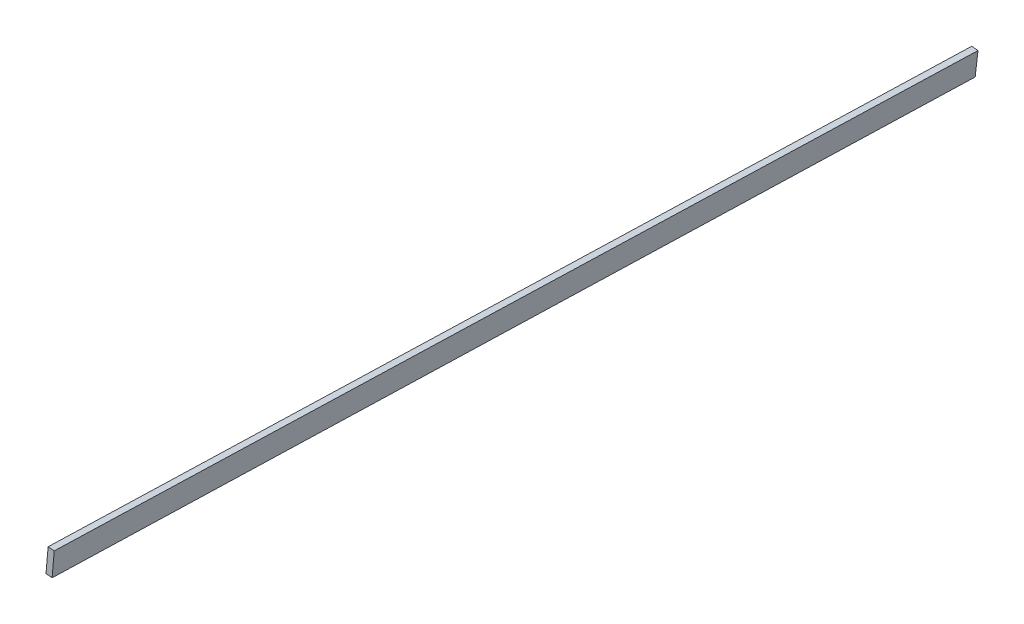
ISO-10303-21;
HEADER;
FILE_DESCRIPTION(('STEP AP214'),'2;1');
FILE_NAME('part.step','',(''),(''),'','','');
FILE_SCHEMA(('AUTOMOTIVE_DESIGN { 1 0 10303 214 1 1 1 1 }'));
ENDSEC;
DATA;
#1=APPLICATION_CONTEXT('core data for automotive mechanical design processes');
#2=APPLICATION_PROTOCOL_DEFINITION('international standard','automotive_design',2000,#1);
#3=PRODUCT_CONTEXT('',#1,'mechanical');
#4=PRODUCT('Part','Part','',(#3));
#5=PRODUCT_RELATED_PRODUCT_CATEGORY('part','',(#4));
#6=PRODUCT_DEFINITION_FORMATION('','',#4);
#7=PRODUCT_DEFINITION_CONTEXT('part definition',#1,'design');
#8=PRODUCT_DEFINITION('design','',#6,#7);
#9=PRODUCT_DEFINITION_SHAPE('','',#8);
#10=(LENGTH_UNIT() NAMED_UNIT(*) SI_UNIT(.MILLI.,.METRE.));
#11=(NAMED_UNIT(*) PLANE_ANGLE_UNIT() SI_UNIT($,.RADIAN.));
#12=(NAMED_UNIT(*) SI_UNIT($,.STERADIAN.) SOLID_ANGLE_UNIT());
#13=UNCERTAINTY_MEASURE_WITH_UNIT(LENGTH_MEASURE(1.E-05),#10,'distance_accuracy_value','');
#14=(GEOMETRIC_REPRESENTATION_CONTEXT(3) GLOBAL_UNCERTAINTY_ASSIGNED_CONTEXT((#13)) GLOBAL_UNIT_ASSIGNED_CONTEXT((#10,
#11,#12)) REPRESENTATION_CONTEXT('',''));
#15=CARTESIAN_POINT('',(0.,0.,0.));
#16=DIRECTION('',(0.,0.,1.));
#17=DIRECTION('',(1.,0.,0.));
#18=AXIS2_PLACEMENT_3D('',#15,#16,#17);
#19=CARTESIAN_POINT('',(0.,0.,-478.663));
#20=DIRECTION('',(0.,0.,-1.));
#21=DIRECTION('',(-1.,0.,0.));
#22=AXIS2_PLACEMENT_3D('',#19,#20,#21);
#23=PLANE('',#22);
#24=DIRECTION('',(0.115362470191797,0.993323462156838,0.));
#25=VECTOR('',#24,1.);
#26=CARTESIAN_POINT('',(289.037781570803,-33.5682320322562,-478.663));
#27=LINE('',#26,#25);
#28=CARTESIAN_POINT('',(296.472728055268,30.4500467946571,-478.663));
#29=VERTEX_POINT('',#28);
#30=CARTESIAN_POINT('',(297.937186245587,43.0596993760035,-478.663));
#31=VERTEX_POINT('',#30);
#32=EDGE_CURVE('E205',#29,#31,#27,.T.);
#33=ORIENTED_EDGE('',*,*,#32,.F.);
#34=DIRECTION('',(0.993725072979922,-0.111850254049998,0.));
#35=VECTOR('',#34,1.);
#36=CARTESIAN_POINT('',(7.09348997460711,63.0215720345871,-478.663));
#37=LINE('',#36,#35);
#38=CARTESIAN_POINT('',(293.317650948557,30.8051713512659,-478.663));
#39=VERTEX_POINT('',#38);
#40=EDGE_CURVE('E196',#39,#29,#37,.T.);
#41=ORIENTED_EDGE('',*,*,#40,.F.);
#42=DIRECTION('',(-0.111850254049959,-0.993725072979926,0.));
#43=VECTOR('',#42,1.);
#44=CARTESIAN_POINT('',(286.224160973954,-32.2164006833102,-478.663));
#45=LINE('',#44,#43);
#46=CARTESIAN_POINT('',(294.738149184402,43.4254797770516,-478.663000000001));
#47=VERTEX_POINT('',#46);
#48=EDGE_CURVE('E70',#47,#39,#45,.T.);
#49=ORIENTED_EDGE('',*,*,#48,.F.);
#50=CARTESIAN_POINT('',(39.9278429354344,0.,-478.663));
#51=CARTESIAN_POINT('',(39.8657355030388,0.471738861701327,-478.663));
#52=CARTESIAN_POINT('',(39.7412418233404,1.41733433207799,-478.663));
#53=CARTESIAN_POINT('',(39.8014992306979,2.86293780882031,-478.663));
#54=CARTESIAN_POINT('',(40.0435881073942,4.31743973085277,-478.663));
#55=CARTESIAN_POINT('',(40.4858457955378,5.78200614021087,-478.663));
#56=CARTESIAN_POINT('',(41.1210865702239,7.25447537763585,-478.663));
#57=CARTESIAN_POINT('',(41.9499403425719,8.73401937480033,-478.663));
#58=CARTESIAN_POINT('',(42.9705324204878,10.2195633421164,-478.663));
#59=CARTESIAN_POINT('',(44.1826856703149,11.7097016533522,-478.663));
#60=CARTESIAN_POINT('',(45.5848116190858,13.2032540866964,-478.663));
#61=CARTESIAN_POINT('',(47.1769606110042,14.6975906017416,-478.663));
#62=CARTESIAN_POINT('',(48.9568569531255,16.1916816805482,-478.663));
#63=CARTESIAN_POINT('',(50.9233741729635,17.6832523271647,-478.663));
#64=CARTESIAN_POINT('',(53.0758368025684,19.1685333153536,-478.663));
#65=CARTESIAN_POINT('',(55.4112771315268,20.6465924822314,-478.663));
#66=CARTESIAN_POINT('',(57.9287136524455,22.113680534508,-478.663));
#67=CARTESIAN_POINT('',(60.6257230087473,23.5670725709571,-478.663));
#68=CARTESIAN_POINT('',(63.4995976263182,25.0045399616052,-478.663));
#69=CARTESIAN_POINT('',(66.548289312539,26.4220553746558,-478.663));
#70=CARTESIAN_POINT('',(69.7683476016566,27.8180051184808,-478.663));
#71=CARTESIAN_POINT('',(73.1573670243377,29.1881334965629,-478.663));
#72=CARTESIAN_POINT('',(76.7113758901145,30.5305697748545,-478.663));
#73=CARTESIAN_POINT('',(80.4276517068769,31.8411783203375,-478.663));
#74=CARTESIAN_POINT('',(84.3016294259345,33.1190287102848,-478.663));
#75=CARTESIAN_POINT('',(88.3303811617404,34.3592759243895,-478.663));
#76=CARTESIAN_POINT('',(92.5092103588319,35.560557175507,-478.663));
#77=CARTESIAN_POINT('',(96.8338913079398,36.7201471301192,-478.663));
#78=CARTESIAN_POINT('',(101.300040036436,37.8352632841516,-478.663));
#79=CARTESIAN_POINT('',(105.902855534395,38.9038641890345,-478.663));
#80=CARTESIAN_POINT('',(110.637554275958,39.9240880593518,-478.663));
#81=CARTESIAN_POINT('',(115.49912431998,40.8928745770555,-478.663));
#82=CARTESIAN_POINT('',(120.482272730011,41.8099709327542,-478.663));
#83=CARTESIAN_POINT('',(125.581727333875,42.6726885051592,-478.663));
#84=CARTESIAN_POINT('',(130.791984372285,43.4801446390006,-478.663));
#85=CARTESIAN_POINT('',(136.107462486511,44.2300069495439,-478.663));
#86=CARTESIAN_POINT('',(141.522197574163,44.9226839958815,-478.663));
#87=CARTESIAN_POINT('',(147.030267001792,45.556817635471,-478.663));
#88=CARTESIAN_POINT('',(152.625767796557,46.1306036000922,-478.663));
#89=CARTESIAN_POINT('',(158.302470243132,46.6456024699738,-478.663));
#90=CARTESIAN_POINT('',(164.054425098867,47.0996675348524,-478.663));
#91=CARTESIAN_POINT('',(169.875312603121,47.4929196032938,-478.663));
#92=CARTESIAN_POINT('',(175.758650713526,47.8270105920672,-478.663));
#93=CARTESIAN_POINT('',(181.698057069012,48.0998114370645,-478.663));
#94=CARTESIAN_POINT('',(187.687028621125,48.3136066288164,-478.663));
#95=CARTESIAN_POINT('',(193.719089230696,48.4683035127761,-478.663));
#96=CARTESIAN_POINT('',(199.787843751074,48.5641907167495,-478.663));
#97=CARTESIAN_POINT('',(205.886629585358,48.6025809674322,-478.663));
#98=CARTESIAN_POINT('',(212.009060312847,48.5847923888063,-478.663));
#99=CARTESIAN_POINT('',(218.148480137534,48.511143258745,-478.663));
#100=CARTESIAN_POINT('',(224.298503089535,48.3836459075008,-478.663));
#101=CARTESIAN_POINT('',(230.452470262941,48.2031019295653,-478.663));
#102=CARTESIAN_POINT('',(236.603993634736,47.971241104442,-478.663));
#103=CARTESIAN_POINT('',(242.746541159821,47.6894630374681,-478.663));
#104=CARTESIAN_POINT('',(248.873720509852,47.3597092242678,-478.663));
#105=CARTESIAN_POINT('',(254.97931178675,46.9842795907467,-478.663));
#106=CARTESIAN_POINT('',(261.056811805734,46.5634558644705,-478.663));
#107=CARTESIAN_POINT('',(267.100212139501,46.1009377247458,-478.663));
#108=CARTESIAN_POINT('',(273.103140356113,45.5974376877133,-478.663));
#109=CARTESIAN_POINT('',(279.059787751442,45.0558088424675,-478.663));
#110=CARTESIAN_POINT('',(284.963964276411,44.4776394666588,-478.663));
#111=CARTESIAN_POINT('',(290.809692834341,43.8654249293648,-478.663));
#112=CARTESIAN_POINT('',(296.591174892215,43.221079634252,-478.663));
#113=CARTESIAN_POINT('',(302.302848338086,42.5482313391464,-478.663));
#114=CARTESIAN_POINT('',(308.023040549913,41.8319845725607,-478.663));
#115=CARTESIAN_POINT('',(313.755025892286,41.1016950367593,-478.663));
#116=CARTESIAN_POINT('',(319.470432002722,40.2237644065586,-478.663));
#117=CARTESIAN_POINT('',(325.077299289718,39.2468511060344,-478.663));
#118=CARTESIAN_POINT('',(330.560090670794,38.1717168139099,-478.663));
#119=CARTESIAN_POINT('',(335.914207797279,37.0090951990215,-478.663));
#120=CARTESIAN_POINT('',(341.135394770521,35.7659859399604,-478.663));
#121=CARTESIAN_POINT('',(346.219226346396,34.4507100000433,-478.663));
#122=CARTESIAN_POINT('',(351.162478322838,33.0728457650995,-478.663));
#123=CARTESIAN_POINT('',(355.961029875707,31.6394596211019,-478.663));
#124=CARTESIAN_POINT('',(360.612092961529,30.1598449561996,-478.663));
#125=CARTESIAN_POINT('',(365.112341598924,28.6420375822945,-478.663));
#126=CARTESIAN_POINT('',(369.459592657379,27.0958975362601,-478.663));
#127=CARTESIAN_POINT('',(373.650596368742,25.5281816759592,-478.663));
#128=CARTESIAN_POINT('',(377.683735784805,23.9490457256147,-478.663));
#129=CARTESIAN_POINT('',(381.55662308499,22.3656819419646,-478.663));
#130=CARTESIAN_POINT('',(385.267609436311,20.7871012786672,-478.663));
#131=CARTESIAN_POINT('',(388.814579937328,19.2201431565423,-478.663));
#132=CARTESIAN_POINT('',(392.196553962396,17.6745492247293,-478.663));
#133=CARTESIAN_POINT('',(395.411588669605,16.1566203231407,-478.663));
#134=CARTESIAN_POINT('',(398.458586597445,14.6744545288923,-478.663));
#135=CARTESIAN_POINT('',(401.33653268194,13.2354422030146,-478.663));
#136=CARTESIAN_POINT('',(404.044070071934,11.8455722171054,-478.663));
#137=CARTESIAN_POINT('',(406.580704943788,10.5125193998001,-478.663));
#138=CARTESIAN_POINT('',(408.945463813322,9.24201771246735,-478.663));
#139=CARTESIAN_POINT('',(411.13749988254,8.04052965266321,-478.663));
#140=CARTESIAN_POINT('',(413.156398271965,6.91348155799918,-478.663));
#141=CARTESIAN_POINT('',(415.001466379773,5.86623381100311,-478.663));
#142=CARTESIAN_POINT('',(416.671989481185,4.90306539209381,-478.663));
#143=CARTESIAN_POINT('',(418.167822287151,4.02942935997889,-478.663));
#144=CARTESIAN_POINT('',(419.4883951934,3.24886476384169,-478.663));
#145=CARTESIAN_POINT('',(420.633573027897,2.56502681173418,-478.663));
#146=CARTESIAN_POINT('',(421.603078349159,1.98114932230697,-478.663));
#147=CARTESIAN_POINT('',(422.396305995499,1.49912939924268,-478.663));
#148=CARTESIAN_POINT('',(423.013655169844,1.1223425168513,-478.663));
#149=CARTESIAN_POINT('',(423.454646277708,0.851788775395058,-478.663));
#150=CARTESIAN_POINT('',(423.719472788357,0.68934780641525,-478.663));
#151=CARTESIAN_POINT('',(423.837007337895,0.616740215475779,-478.663));
#152=CARTESIAN_POINT('',(423.866419521017,0.598570683459969,-478.663));
#153=B_SPLINE_CURVE_WITH_KNOTS('',3,(#50,#51,#52,#53,#54,#55,#56,#57,#58,#59,#60,#61,#62,#63,
#64,#65,#66,#67,#68,#69,#70,#71,#72,#73,#74,#75,#76,#77,#78,#79,#80,#81,#82,#83,#84,#85,#86,#87,
#88,#89,#90,#91,#92,#93,#94,#95,#96,#97,#98,#99,#100,#101,#102,#103,#104,#105,#106,#107,#108,
#109,#110,#111,#112,#113,#114,#115,#116,#117,#118,#119,#120,#121,#122,#123,#124,#125,#126,#127,
#128,#129,#130,#131,#132,#133,#134,#135,#136,#137,#138,#139,#140,#141,#142,#143,#144,#145,#146,
#147,#148,#149,#150,#151,#152),.UNSPECIFIED.,.F.,.F.,(4,1,1,1,1,1,1,1,1,1,1,1,1,1,1,1,1,1,1,1,1,
1,1,1,1,1,1,1,1,1,1,1,1,1,1,1,1,1,1,1,1,1,1,1,1,1,1,1,1,1,1,1,1,1,1,1,1,1,1,1,1,1,1,1,1,1,1,1,1,
1,1,1,1,1,1,1,1,1,1,1,1,1,1,1,1,1,1,1,1,1,1,1,1,1,1,1,1,1,1,1,4),(0.,0.00349158406172634,
0.00699884266753137,0.010584891001013,0.0143057738060091,0.018212957002912,0.0223489592495324,
0.0267500871703396,0.0314434001009153,0.0364533478479211,0.0417951811298695,0.0474824739840348,
0.053525220011689,0.0599287797612433,0.0666973740748233,0.0738337467784175,0.0813392655292733,
0.0892106143778258,0.0974471026699232,0.106046574244149,0.11500228099912,0.124311157144941,
0.133966165490781,0.1439621467403,0.15429042880244,0.164945397634917,0.175917090581381,
0.1871963143991,0.198776039986041,0.21064431501338,0.222791848004837,0.235207958129106,
0.247882413492289,0.260802286813156,0.273957355243071,0.287334904946915,0.300921852482959,
0.31470598609748,0.328674454147543,0.342813945919347,0.357111324942549,0.371552525007795,
0.38612316184337,0.400809007965877,0.415596583076115,0.430470453895741,0.445417016025388,
0.460420679976601,0.475467653540201,0.490542167263301,0.505630260071093,0.520715991082178,
0.535785217707677,0.550822734754853,0.565813250446359,0.580743399202012,0.595596683292698,
0.610359545464631,0.625017279453834,0.639556130332767,0.653960323151271,0.668215888867977,
0.682310773256923,0.696228800058483,0.710585855975916,0.724777289727699,0.738723177380373,
0.752412549480951,0.7658381692567,0.778988406277182,0.791856444226357,0.804430395983943,
0.81670230081389,0.828661874094511,0.840300239924397,0.851606382109714,0.862571699525893,
0.873185724038188,0.883438426750839,0.893321888193432,0.902824243446795,0.911937089713061,
0.920650173378921,0.928954175605772,0.936839815793609,0.944298335730914,0.951321935831775,
0.957900477144578,0.96402779434212,0.969693763215075,0.974894023689597,0.979620339179358,
0.983865976398503,0.987625510061292,0.990894725538664,0.993669018208423,0.995943422630923,
0.997716640851334,0.998984626496478,0.999745910019303,1.),.UNSPECIFIED.);
#154=EDGE_CURVE('E12',#47,#31,#153,.T.);
#155=ORIENTED_EDGE('',*,*,#154,.T.);
#156=EDGE_LOOP('',(#33,#41,#49,#155));
#157=FACE_BOUND('',#156,.T.);
#158=ADVANCED_FACE('F59',(#157),#23,.T.);
#159=CARTESIAN_POINT('',(0.,0.,0.));
#160=DIRECTION('',(0.,0.,1.));
#161=DIRECTION('',(1.,0.,0.));
#162=AXIS2_PLACEMENT_3D('',#159,#160,#161);
#163=PLANE('',#162);
#164=DIRECTION('',(0.0862609880201649,0.996272574121051,0.));
#165=VECTOR('',#164,1.);
#166=CARTESIAN_POINT('',(290.409557049172,-25.1447404779369,0.));
#167=LINE('',#166,#165);
#168=CARTESIAN_POINT('',(296.472728055268,44.8819439389783,0.));
#169=VERTEX_POINT('',#168);
#170=CARTESIAN_POINT('',(297.567841990426,57.529978747974,0.));
#171=VERTEX_POINT('',#170);
#172=EDGE_CURVE('E172',#169,#171,#167,.T.);
#173=ORIENTED_EDGE('',*,*,#172,.T.);
#174=CARTESIAN_POINT('',(486.193791136,0.757989339999986,0.));
#175=CARTESIAN_POINT('',(486.156545565361,0.780998011435036,0.));
#176=CARTESIAN_POINT('',(486.007707870909,0.872943377020896,0.));
#177=CARTESIAN_POINT('',(485.672349581762,1.07864763611412,0.));
#178=CARTESIAN_POINT('',(485.113908291829,1.42125843999752,0.));
#179=CARTESIAN_POINT('',(484.332139179152,1.89839593924907,0.));
#180=CARTESIAN_POINT('',(483.327649378144,2.50879319131129,0.));
#181=CARTESIAN_POINT('',(482.099933618061,3.24817605291873,0.));
#182=CARTESIAN_POINT('',(480.649758177878,4.11414228025912,0.));
#183=CARTESIAN_POINT('',(478.977474041683,5.10259617373777,0.));
#184=CARTESIAN_POINT('',(477.083252711746,6.20890972510926,0.));
#185=CARTESIAN_POINT('',(474.967815399541,7.4286009034661,0.));
#186=CARTESIAN_POINT('',(472.631346146374,8.75476446910173,0.));
#187=CARTESIAN_POINT('',(470.074750091032,10.1819817066978,0.));
#188=CARTESIAN_POINT('',(467.298904376365,11.7034648979433,0.));
#189=CARTESIAN_POINT('',(464.304334104304,13.3123421553702,0.));
#190=CARTESIAN_POINT('',(461.092111508869,15.000429680272,0.));
#191=CARTESIAN_POINT('',(457.66346974577,16.7604670076838,0.));
#192=CARTESIAN_POINT('',(454.0190338335,18.5827346953726,0.));
#193=CARTESIAN_POINT('',(450.160522055661,20.4596487633212,0.));
#194=CARTESIAN_POINT('',(446.089220059658,22.3818513690475,0.));
#195=CARTESIAN_POINT('',(441.806517314033,24.3390865091975,0.));
#196=CARTESIAN_POINT('',(437.314874313997,26.3233762300568,0.));
#197=CARTESIAN_POINT('',(432.615532728645,28.3223837017805,0.));
#198=CARTESIAN_POINT('',(427.711170693804,30.3274484059496,0.));
#199=CARTESIAN_POINT('',(422.603876176864,32.3271589303653,0.));
#200=CARTESIAN_POINT('',(417.296673201285,34.3124081928799,0.));
#201=CARTESIAN_POINT('',(411.791609238653,36.2703351275022,0.));
#202=CARTESIAN_POINT('',(406.092799426548,38.1923836204457,0.));
#203=CARTESIAN_POINT('',(400.203008280872,40.0660671875782,0.));
#204=CARTESIAN_POINT('',(394.126447784507,41.8812102987039,0.));
#205=CARTESIAN_POINT('',(387.866648542298,43.6260442111925,0.));
#206=CARTESIAN_POINT('',(381.428828749611,45.2916204870301,0.));
#207=CARTESIAN_POINT('',(374.817071410062,46.865809767724,0.));
#208=CARTESIAN_POINT('',(368.03698039514,48.3380750058247,0.));
#209=CARTESIAN_POINT('',(361.093945074783,49.699552264347,0.));
#210=CARTESIAN_POINT('',(353.993788332329,50.9366490018386,0.));
#211=CARTESIAN_POINT('',(346.756185399731,52.0484008148347,0.));
#212=CARTESIAN_POINT('',(339.49758769736,52.9731900404694,0.));
#213=CARTESIAN_POINT('',(332.253923966388,53.8801963966564,0.));
#214=CARTESIAN_POINT('',(325.021047815005,54.7322458465364,0.));
#215=CARTESIAN_POINT('',(317.699770737049,55.5482010808888,0.));
#216=CARTESIAN_POINT('',(310.297136308343,56.3234680857997,0.));
#217=CARTESIAN_POINT('',(302.820487344147,57.0556225387862,0.));
#218=CARTESIAN_POINT('',(295.277392797908,57.7415046826616,0.));
#219=CARTESIAN_POINT('',(287.675691416606,58.3791029639876,0.));
#220=CARTESIAN_POINT('',(280.022738791621,58.9648045978675,0.));
#221=CARTESIAN_POINT('',(272.326604726296,59.4977071844643,0.));
#222=CARTESIAN_POINT('',(264.594897726286,59.9731259153054,0.));
#223=CARTESIAN_POINT('',(256.835853078089,60.3907037202014,0.));
#224=CARTESIAN_POINT('',(249.057347189727,60.7475284214375,0.));
#225=CARTESIAN_POINT('',(241.267474913243,61.0411412461608,0.));
#226=CARTESIAN_POINT('',(233.474507977737,61.2697698609126,0.));
#227=CARTESIAN_POINT('',(225.68653574506,61.431223872975,0.));
#228=CARTESIAN_POINT('',(217.911990598436,61.524488163252,0.));
#229=CARTESIAN_POINT('',(210.158959276691,61.5470144410123,0.));
#230=CARTESIAN_POINT('',(202.435870243933,61.4983996026268,0.));
#231=CARTESIAN_POINT('',(194.750810841996,61.3769745464705,0.));
#232=CARTESIAN_POINT('',(187.112218127082,61.181076903317,0.));
#233=CARTESIAN_POINT('',(181.89943280618,60.9949901189179,0.));
#234=CARTESIAN_POINT('',(179.233533133777,60.8853864765985,0.));
#235=CARTESIAN_POINT('',(179.095862456923,60.8796877429413,0.));
#236=B_SPLINE_CURVE_WITH_KNOTS('',3,(#174,#175,#176,#177,#178,#179,#180,#181,#182,#183,#184,
#185,#186,#187,#188,#189,#190,#191,#192,#193,#194,#195,#196,#197,#198,#199,#200,#201,#202,#203,
#204,#205,#206,#207,#208,#209,#210,#211,#212,#213,#214,#215,#216,#217,#218,#219,#220,#221,#222,
#223,#224,#225,#226,#227,#228,#229,#230,#231,#232,#233,#234,#235),.UNSPECIFIED.,.F.,.F.,(4,1,1,
1,1,1,1,1,1,1,1,1,1,1,1,1,1,1,1,1,1,1,1,1,1,1,1,1,1,1,1,1,1,1,1,1,1,1,1,1,1,1,1,1,1,1,1,1,1,1,1,
1,1,1,1,1,1,1,1,4),(0.,0.000254089882309868,0.00101537314688499,0.00228335895489384,
0.00405657711436425,0.0063309816286097,0.00910527429772043,0.0123744892933041,
0.0161340232508612,0.0203796606056697,0.0251059761772477,0.0303062367559461,0.0359722057137207,
0.0420995223409456,0.04867806356196,0.0557016639745229,0.0631601837328947,0.0710458238596082,
0.0793498265992156,0.0880629098378995,0.0971757565527032,0.106678111473361,0.116561572968828,
0.126814275701842,0.137428300683038,0.14839361777696,0.159699759746816,0.171338125326603,
0.183297698999255,0.195569603893594,0.208143555513449,0.221011593461283,0.234161830869065,
0.247587450405984,0.261276822232609,0.275222710022191,0.289414144007399,0.303771199572695,
0.317689226313621,0.331784111177709,0.346039676575272,0.360443869550984,0.374982720532623,
0.389640454117201,0.404403316685164,0.419256600465661,0.434186749405522,0.449177264946611,
0.464214782140165,0.479284008753232,0.494369739797949,0.509457832640945,0.524532346315463,
0.539579319873602,0.55458298383554,0.56952954600936,0.584403416831243,0.599190991892228,
0.613876838026088,0.61467654210189),.UNSPECIFIED.);
#237=CARTESIAN_POINT('',(294.40507718029,57.8084842672797,0.));
#238=VERTEX_POINT('',#237);
#239=EDGE_CURVE('E129',#171,#238,#236,.T.);
#240=ORIENTED_EDGE('',*,*,#239,.T.);
#241=DIRECTION('',(-0.0862609880201664,-0.996272574121051,0.));
#242=VECTOR('',#241,1.);
#243=CARTESIAN_POINT('',(287.246391626338,-24.8708618409734,0.));
#244=LINE('',#243,#242);
#245=CARTESIAN_POINT('',(293.309562632434,45.1558225759424,0.));
#246=VERTEX_POINT('',#245);
#247=EDGE_CURVE('E106',#238,#246,#244,.T.);
#248=ORIENTED_EDGE('',*,*,#247,.T.);
#249=DIRECTION('',(0.996272574121051,-0.0862609880201683,0.));
#250=VECTOR('',#249,1.);
#251=CARTESIAN_POINT('',(6.06317100609634,70.0266844169163,0.));
#252=LINE('',#251,#250);
#253=EDGE_CURVE('E115',#246,#169,#252,.T.);
#254=ORIENTED_EDGE('',*,*,#253,.T.);
#255=EDGE_LOOP('',(#173,#240,#248,#254));
#256=FACE_BOUND('',#255,.T.);
#257=ADVANCED_FACE('F128',(#256),#163,.T.);
#258=CARTESIAN_POINT('',(296.472728055268,44.8819439389783,0.));
#259=CARTESIAN_POINT('',(296.472728055268,30.4500467946571,-478.663));
#260=CARTESIAN_POINT('',(295.945533818129,44.9275903784723,0.));
#261=CARTESIAN_POINT('',(295.946881870817,30.5092342207585,-478.663));
#262=CARTESIAN_POINT('',(295.418339580991,44.9732368179663,0.));
#263=CARTESIAN_POINT('',(295.421035686365,30.5684216468599,-478.663));
#264=CARTESIAN_POINT('',(294.363951106712,45.0645296969543,0.));
#265=CARTESIAN_POINT('',(294.369343317462,30.6867964990628,-478.663));
#266=CARTESIAN_POINT('',(293.836756869573,45.1101761364483,0.));
#267=CARTESIAN_POINT('',(293.84349713301,30.7459839251643,-478.663));
#268=CARTESIAN_POINT('',(293.309562632434,45.1558225759424,0.));
#269=CARTESIAN_POINT('',(293.317650948557,30.8051713512659,-478.663));
#270=B_SPLINE_SURFACE_WITH_KNOTS('',3,1,((#258,#259),(#260,#261),(#262,#263),(#264,#265),(#266,
#267),(#268,#269)),.UNSPECIFIED.,.F.,.F.,.F.,(4,2,4),(2,2),(0.,0.5,1.),(0.,1.),.UNSPECIFIED.);
#271=DIRECTION('',(1.68901367147207E-05,-0.0299672339015207,-0.999550881449771));
#272=VECTOR('',#271,1.);
#273=CARTESIAN_POINT('',(293.313606790495,37.9804969636041,-239.3315));
#274=LINE('',#273,#272);
#275=EDGE_CURVE('E102',#246,#39,#274,.T.);
#276=DIRECTION('',(0.,0.0301367391354708,0.999545785321653));
#277=VECTOR('',#276,1.);
#278=CARTESIAN_POINT('',(296.472728055268,37.6659953668177,-239.3315));
#279=LINE('',#278,#277);
#280=EDGE_CURVE('E112',#29,#169,#279,.T.);
#281=ORIENTED_EDGE('',*,*,#253,.F.);
#282=ORIENTED_EDGE('',*,*,#275,.T.);
#283=ORIENTED_EDGE('',*,*,#40,.T.);
#284=ORIENTED_EDGE('',*,*,#280,.T.);
#285=EDGE_LOOP('',(#281,#282,#283,#284));
#286=FACE_BOUND('',#285,.T.);
#287=ADVANCED_FACE('F117',(#286),#270,.T.);
#288=CARTESIAN_POINT('',(293.309562632434,45.1558225759424,0.));
#289=CARTESIAN_POINT('',(293.317650948557,30.8051713512659,-478.663));
#290=CARTESIAN_POINT('',(293.49214839041,47.2645995244986,0.));
#291=CARTESIAN_POINT('',(293.554400652963,32.9085560890735,-478.663));
#292=CARTESIAN_POINT('',(293.674734148386,49.3733764730548,0.));
#293=CARTESIAN_POINT('',(293.791150357368,35.011940826881,-478.663));
#294=CARTESIAN_POINT('',(294.039905664338,53.5909303701672,0.));
#295=CARTESIAN_POINT('',(294.26464976618,39.218710302496,-478.663));
#296=CARTESIAN_POINT('',(294.222491422314,55.6997073187235,0.));
#297=CARTESIAN_POINT('',(294.501399470586,41.3220950403035,-478.663));
#298=CARTESIAN_POINT('',(294.40507718029,57.8084842672797,0.));
#299=CARTESIAN_POINT('',(294.738149174991,43.4254797781109,-478.663));
#300=B_SPLINE_SURFACE_WITH_KNOTS('',3,1,((#288,#289),(#290,#291),(#292,#293),(#294,#295),(#296,
#297),(#298,#299)),.UNSPECIFIED.,.F.,.F.,.F.,(4,2,4),(2,2),(0.,0.5,1.),(0.,1.),.UNSPECIFIED.);
#301=DIRECTION('',(0.000695524096531632,-0.0300347263110679,-0.9995486138561));
#302=VECTOR('',#301,1.);
#303=CARTESIAN_POINT('',(294.571613177641,50.6169820226953,-239.3315));
#304=LINE('',#303,#302);
#305=EDGE_CURVE('E85',#238,#47,#304,.T.);
#306=ORIENTED_EDGE('',*,*,#247,.F.);
#307=ORIENTED_EDGE('',*,*,#305,.T.);
#308=ORIENTED_EDGE('',*,*,#48,.T.);
#309=ORIENTED_EDGE('',*,*,#275,.F.);
#310=EDGE_LOOP('',(#306,#307,#308,#309));
#311=FACE_BOUND('',#310,.T.);
#312=ADVANCED_FACE('F104',(#311),#300,.T.);
#313=CARTESIAN_POINT('',(297.567841990428,57.5299787479739,0.));
#314=CARTESIAN_POINT('',(297.937186235905,43.0596993771279,-478.663));
#315=CARTESIAN_POINT('',(297.385323001235,55.4219729464747,0.));
#316=CARTESIAN_POINT('',(297.693109872466,40.9580906133828,-478.663));
#317=CARTESIAN_POINT('',(297.202804012041,53.3139671449754,0.));
#318=CARTESIAN_POINT('',(297.449033509026,38.8564818496377,-478.663));
#319=CARTESIAN_POINT('',(296.837766033655,49.0979555419769,0.));
#320=CARTESIAN_POINT('',(296.960880782147,34.6532643221474,-478.663));
#321=CARTESIAN_POINT('',(296.655247044461,46.9899497404776,0.));
#322=CARTESIAN_POINT('',(296.716804418708,32.5516555584023,-478.663));
#323=CARTESIAN_POINT('',(296.472728055268,44.8819439389783,0.));
#324=CARTESIAN_POINT('',(296.472728055268,30.4500467946572,-478.663));
#325=B_SPLINE_SURFACE_WITH_KNOTS('',3,1,((#313,#314),(#315,#316),(#317,#318),(#319,#320),(#321,
#322),(#323,#324)),.UNSPECIFIED.,.F.,.F.,.F.,(4,2,4),(2,2),(0.,0.5,1.),(0.,1.),.UNSPECIFIED.);
#326=DIRECTION('',(0.000771263897280411,-0.0302168069686756,-0.999543070472013));
#327=VECTOR('',#326,1.);
#328=CARTESIAN_POINT('',(297.752514118007,50.2948390619888,-239.3315));
#329=LINE('',#328,#327);
#330=EDGE_CURVE('E213',#171,#31,#329,.T.);
#331=ORIENTED_EDGE('',*,*,#172,.F.);
#332=ORIENTED_EDGE('',*,*,#280,.F.);
#333=ORIENTED_EDGE('',*,*,#32,.T.);
#334=ORIENTED_EDGE('',*,*,#330,.F.);
#335=EDGE_LOOP('',(#331,#332,#333,#334));
#336=FACE_BOUND('',#335,.T.);
#337=ADVANCED_FACE('F243',(#336),#325,.T.);
#338=CARTESIAN_POINT('',(294.40507718029,57.8084842672797,0.));
#339=CARTESIAN_POINT('',(294.738149184402,43.4254797770516,-478.663000000001));
#340=CARTESIAN_POINT('',(294.701616965249,57.78280874885,0.));
#341=CARTESIAN_POINT('',(295.038111051702,43.3917171076995,-478.663000000001));
#342=CARTESIAN_POINT('',(295.319227905143,57.7290768928571,0.));
#343=CARTESIAN_POINT('',(295.662836760236,43.3210848735962,-478.663000000001));
#344=CARTESIAN_POINT('',(296.373501328028,57.6364462580653,0.));
#345=CARTESIAN_POINT('',(296.72921132522,43.1994065080046,-478.663000000001));
#346=CARTESIAN_POINT('',(297.131197452719,57.5690716309821,0.));
#347=CARTESIAN_POINT('',(297.495566443672,43.1109881587418,-478.663000000001));
#348=CARTESIAN_POINT('',(297.567841990426,57.529978747974,0.));
#349=CARTESIAN_POINT('',(297.937186245587,43.0596993760035,-478.663000000001));
#350=B_SPLINE_SURFACE_WITH_KNOTS('',3,1,((#338,#339),(#340,#341),(#342,#343),(#344,#345),(#346,
#347),(#348,#349)),.UNSPECIFIED.,.F.,.F.,.F.,(4,1,1,4),(2,2),(0.,0.281242966737679,
0.58577280250499,1.),(0.,1.),.UNSPECIFIED.);
#351=ORIENTED_EDGE('',*,*,#239,.F.);
#352=ORIENTED_EDGE('',*,*,#330,.T.);
#353=ORIENTED_EDGE('',*,*,#154,.F.);
#354=ORIENTED_EDGE('',*,*,#305,.F.);
#355=EDGE_LOOP('',(#351,#352,#353,#354));
#356=FACE_BOUND('',#355,.T.);
#357=ADVANCED_FACE('F253',(#356),#350,.T.);
#358=CLOSED_SHELL('',(#158,#257,#287,#312,#337,#357));
#359=MANIFOLD_SOLID_BREP('B2',#358);
#360=ADVANCED_BREP_SHAPE_REPRESENTATION('',(#18,#359),#14);
#361=SHAPE_DEFINITION_REPRESENTATION(#9,#360);
ENDSEC;
END-ISO-10303-21;
